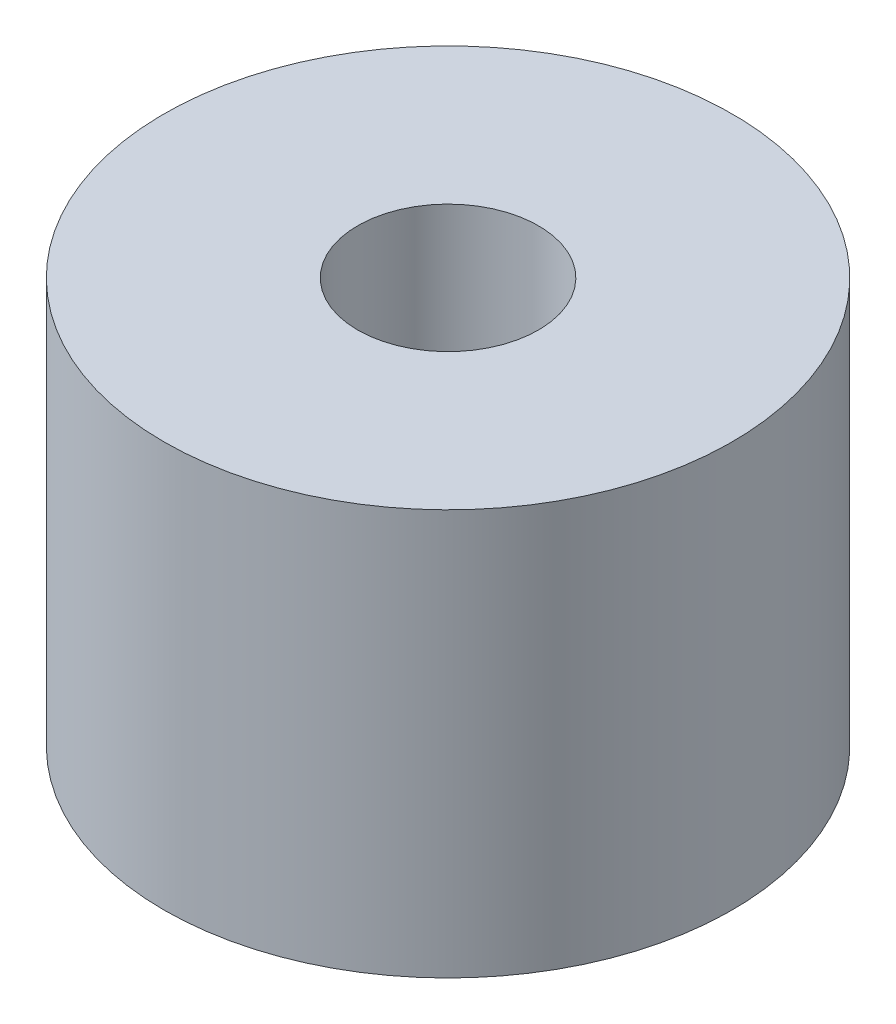
ISO-10303-21;
HEADER;
FILE_DESCRIPTION(('STEP AP214'),'2;1');
FILE_NAME('part.step','',(''),(''),'','','');
FILE_SCHEMA(('AUTOMOTIVE_DESIGN { 1 0 10303 214 1 1 1 1 }'));
ENDSEC;
DATA;
#1=APPLICATION_CONTEXT('core data for automotive mechanical design processes');
#2=APPLICATION_PROTOCOL_DEFINITION('international standard','automotive_design',2000,#1);
#3=PRODUCT_CONTEXT('',#1,'mechanical');
#4=PRODUCT('Part','Part','',(#3));
#5=PRODUCT_RELATED_PRODUCT_CATEGORY('part','',(#4));
#6=PRODUCT_DEFINITION_FORMATION('','',#4);
#7=PRODUCT_DEFINITION_CONTEXT('part definition',#1,'design');
#8=PRODUCT_DEFINITION('design','',#6,#7);
#9=PRODUCT_DEFINITION_SHAPE('','',#8);
#10=(LENGTH_UNIT() NAMED_UNIT(*) SI_UNIT(.MILLI.,.METRE.));
#11=(NAMED_UNIT(*) PLANE_ANGLE_UNIT() SI_UNIT($,.RADIAN.));
#12=(NAMED_UNIT(*) SI_UNIT($,.STERADIAN.) SOLID_ANGLE_UNIT());
#13=UNCERTAINTY_MEASURE_WITH_UNIT(LENGTH_MEASURE(1.E-05),#10,'distance_accuracy_value','');
#14=(GEOMETRIC_REPRESENTATION_CONTEXT(3) GLOBAL_UNCERTAINTY_ASSIGNED_CONTEXT((#13)) GLOBAL_UNIT_ASSIGNED_CONTEXT((#10,
#11,#12)) REPRESENTATION_CONTEXT('',''));
#15=CARTESIAN_POINT('',(0.,0.,0.));
#16=DIRECTION('',(0.,0.,1.));
#17=DIRECTION('',(1.,0.,0.));
#18=AXIS2_PLACEMENT_3D('',#15,#16,#17);
#19=CARTESIAN_POINT('',(0.,15.7,0.));
#20=DIRECTION('',(0.,1.,0.));
#21=DIRECTION('',(0.,0.,1.));
#22=AXIS2_PLACEMENT_3D('',#19,#20,#21);
#23=PLANE('',#22);
#24=CARTESIAN_POINT('',(0.,15.7,0.));
#25=DIRECTION('',(0.,1.,0.));
#26=DIRECTION('',(0.,0.,1.));
#27=AXIS2_PLACEMENT_3D('',#24,#25,#26);
#28=CIRCLE('',#27,11.);
#29=CARTESIAN_POINT('',(0.,15.7,11.));
#30=VERTEX_POINT('',#29);
#31=EDGE_CURVE('E10',#30,#30,#28,.T.);
#32=ORIENTED_EDGE('',*,*,#31,.T.);
#33=EDGE_LOOP('',(#32));
#34=FACE_BOUND('',#33,.T.);
#35=CARTESIAN_POINT('',(0.,15.7,0.));
#36=DIRECTION('',(0.,1.,0.));
#37=DIRECTION('',(0.,0.,1.));
#38=AXIS2_PLACEMENT_3D('',#35,#36,#37);
#39=CIRCLE('',#38,3.5);
#40=CARTESIAN_POINT('',(0.,15.7,3.5));
#41=VERTEX_POINT('',#40);
#42=EDGE_CURVE('E42',#41,#41,#39,.T.);
#43=ORIENTED_EDGE('',*,*,#42,.F.);
#44=EDGE_LOOP('',(#43));
#45=FACE_BOUND('',#44,.T.);
#46=ADVANCED_FACE('F31',(#34,#45),#23,.T.);
#47=CARTESIAN_POINT('',(0.,0.,0.));
#48=DIRECTION('',(0.,1.,0.));
#49=DIRECTION('',(0.,0.,1.));
#50=AXIS2_PLACEMENT_3D('',#47,#48,#49);
#51=PLANE('',#50);
#52=CARTESIAN_POINT('',(0.,0.,0.));
#53=DIRECTION('',(0.,1.,0.));
#54=DIRECTION('',(0.,0.,1.));
#55=AXIS2_PLACEMENT_3D('',#52,#53,#54);
#56=CIRCLE('',#55,11.);
#57=CARTESIAN_POINT('',(0.,0.,11.));
#58=VERTEX_POINT('',#57);
#59=EDGE_CURVE('E35',#58,#58,#56,.T.);
#60=ORIENTED_EDGE('',*,*,#59,.F.);
#61=EDGE_LOOP('',(#60));
#62=FACE_BOUND('',#61,.T.);
#63=CARTESIAN_POINT('',(0.,0.,0.));
#64=DIRECTION('',(0.,1.,0.));
#65=DIRECTION('',(0.,0.,1.));
#66=AXIS2_PLACEMENT_3D('',#63,#64,#65);
#67=CIRCLE('',#66,3.5);
#68=CARTESIAN_POINT('',(0.,0.,3.5));
#69=VERTEX_POINT('',#68);
#70=EDGE_CURVE('E44',#69,#69,#67,.T.);
#71=ORIENTED_EDGE('',*,*,#70,.T.);
#72=EDGE_LOOP('',(#71));
#73=FACE_BOUND('',#72,.T.);
#74=ADVANCED_FACE('F54',(#62,#73),#51,.F.);
#75=CARTESIAN_POINT('',(0.,15.7,0.));
#76=DIRECTION('',(0.,-1.,0.));
#77=DIRECTION('',(0.,0.,-1.));
#78=AXIS2_PLACEMENT_3D('',#75,#76,#77);
#79=CYLINDRICAL_SURFACE('',#78,11.);
#80=ORIENTED_EDGE('',*,*,#31,.F.);
#81=EDGE_LOOP('',(#80));
#82=FACE_BOUND('',#81,.T.);
#83=ORIENTED_EDGE('',*,*,#59,.T.);
#84=EDGE_LOOP('',(#83));
#85=FACE_BOUND('',#84,.T.);
#86=ADVANCED_FACE('F33',(#82,#85),#79,.T.);
#87=CARTESIAN_POINT('',(0.,15.7,0.));
#88=DIRECTION('',(0.,-1.,0.));
#89=DIRECTION('',(0.,0.,-1.));
#90=AXIS2_PLACEMENT_3D('',#87,#88,#89);
#91=CYLINDRICAL_SURFACE('',#90,3.5);
#92=ORIENTED_EDGE('',*,*,#42,.T.);
#93=EDGE_LOOP('',(#92));
#94=FACE_BOUND('',#93,.T.);
#95=ORIENTED_EDGE('',*,*,#70,.F.);
#96=EDGE_LOOP('',(#95));
#97=FACE_BOUND('',#96,.T.);
#98=ADVANCED_FACE('F50',(#94,#97),#91,.F.);
#99=CLOSED_SHELL('',(#46,#74,#86,#98));
#100=MANIFOLD_SOLID_BREP('B2',#99);
#101=ADVANCED_BREP_SHAPE_REPRESENTATION('',(#18,#100),#14);
#102=SHAPE_DEFINITION_REPRESENTATION(#9,#101);
ENDSEC;
END-ISO-10303-21;
